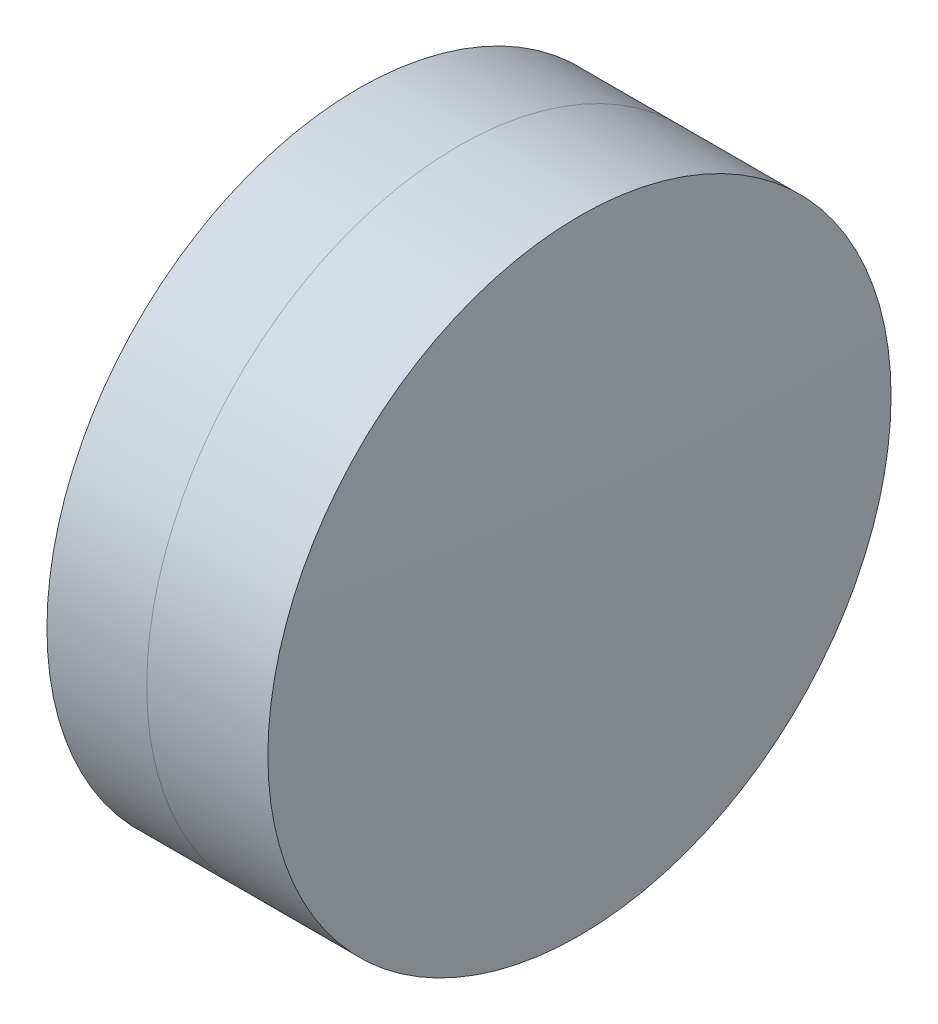
ISO-10303-21;
HEADER;
FILE_DESCRIPTION(('STEP AP214'),'2;1');
FILE_NAME('part.step','',(''),(''),'','','');
FILE_SCHEMA(('AUTOMOTIVE_DESIGN { 1 0 10303 214 1 1 1 1 }'));
ENDSEC;
DATA;
#1=APPLICATION_CONTEXT('core data for automotive mechanical design processes');
#2=APPLICATION_PROTOCOL_DEFINITION('international standard','automotive_design',2000,#1);
#3=PRODUCT_CONTEXT('',#1,'mechanical');
#4=PRODUCT('Part','Part','',(#3));
#5=PRODUCT_RELATED_PRODUCT_CATEGORY('part','',(#4));
#6=PRODUCT_DEFINITION_FORMATION('','',#4);
#7=PRODUCT_DEFINITION_CONTEXT('part definition',#1,'design');
#8=PRODUCT_DEFINITION('design','',#6,#7);
#9=PRODUCT_DEFINITION_SHAPE('','',#8);
#10=(LENGTH_UNIT() NAMED_UNIT(*) SI_UNIT(.MILLI.,.METRE.));
#11=(NAMED_UNIT(*) PLANE_ANGLE_UNIT() SI_UNIT($,.RADIAN.));
#12=(NAMED_UNIT(*) SI_UNIT($,.STERADIAN.) SOLID_ANGLE_UNIT());
#13=UNCERTAINTY_MEASURE_WITH_UNIT(LENGTH_MEASURE(1.E-05),#10,'distance_accuracy_value','');
#14=(GEOMETRIC_REPRESENTATION_CONTEXT(3) GLOBAL_UNCERTAINTY_ASSIGNED_CONTEXT((#13)) GLOBAL_UNIT_ASSIGNED_CONTEXT((#10,
#11,#12)) REPRESENTATION_CONTEXT('',''));
#15=CARTESIAN_POINT('',(0.,0.,0.));
#16=DIRECTION('',(0.,0.,1.));
#17=DIRECTION('',(1.,0.,0.));
#18=AXIS2_PLACEMENT_3D('',#15,#16,#17);
#19=CARTESIAN_POINT('',(-16.3125512292951,0.,0.));
#20=DIRECTION('',(-1.,0.,0.));
#21=DIRECTION('',(0.,0.,1.));
#22=AXIS2_PLACEMENT_3D('',#19,#20,#21);
#23=SPHERICAL_SURFACE('',#22,25.369);
#24=CARTESIAN_POINT('',(8.55884119252153,0.,0.));
#25=DIRECTION('',(-1.,0.,0.));
#26=DIRECTION('',(0.,0.,1.));
#27=AXIS2_PLACEMENT_3D('',#24,#25,#26);
#28=CIRCLE('',#27,5.00000000000001);
#29=CARTESIAN_POINT('',(8.55884119252153,0.,5.00000000000001));
#30=VERTEX_POINT('',#29);
#31=EDGE_CURVE('E11',#30,#30,#28,.T.);
#32=ORIENTED_EDGE('',*,*,#31,.T.);
#33=EDGE_LOOP('',(#32));
#34=FACE_BOUND('',#33,.T.);
#35=ADVANCED_FACE('F47',(#34),#23,.F.);
#36=CARTESIAN_POINT('',(-0.551919992657797,0.,0.));
#37=DIRECTION('',(-1.,0.,0.));
#38=DIRECTION('',(0.,0.,1.));
#39=AXIS2_PLACEMENT_3D('',#36,#37,#38);
#40=CYLINDRICAL_SURFACE('',#39,5.);
#41=CARTESIAN_POINT('',(10.5031711329197,0.,0.));
#42=DIRECTION('',(-1.,0.,0.));
#43=DIRECTION('',(0.,0.,1.));
#44=AXIS2_PLACEMENT_3D('',#41,#42,#43);
#45=CIRCLE('',#44,5.);
#46=CARTESIAN_POINT('',(10.5031711329197,0.,5.));
#47=VERTEX_POINT('',#46);
#48=EDGE_CURVE('E53',#47,#47,#45,.T.);
#49=ORIENTED_EDGE('',*,*,#48,.T.);
#50=EDGE_LOOP('',(#49));
#51=FACE_BOUND('',#50,.T.);
#52=ORIENTED_EDGE('',*,*,#31,.F.);
#53=EDGE_LOOP('',(#52));
#54=FACE_BOUND('',#53,.T.);
#55=ADVANCED_FACE('F59',(#51,#54),#40,.T.);
#56=CARTESIAN_POINT('',(-70.9715512292951,0.,0.));
#57=DIRECTION('',(-1.,0.,0.));
#58=DIRECTION('',(0.,0.,1.));
#59=AXIS2_PLACEMENT_3D('',#56,#57,#58);
#60=SPHERICAL_SURFACE('',#59,81.628);
#61=ORIENTED_EDGE('',*,*,#48,.F.);
#62=EDGE_LOOP('',(#61));
#63=FACE_BOUND('',#62,.T.);
#64=ADVANCED_FACE('F62',(#63),#60,.T.);
#65=CLOSED_SHELL('',(#35,#55,#64));
#66=MANIFOLD_SOLID_BREP('B2',#65);
#67=CARTESIAN_POINT('',(45.7204487707049,0.,0.));
#68=DIRECTION('',(-1.,0.,0.));
#69=DIRECTION('',(0.,0.,1.));
#70=AXIS2_PLACEMENT_3D('',#67,#68,#69);
#71=SPHERICAL_SURFACE('',#70,39.084);
#72=CARTESIAN_POINT('',(6.9575921164282,0.,0.));
#73=DIRECTION('',(-1.,0.,0.));
#74=DIRECTION('',(0.,0.,1.));
#75=AXIS2_PLACEMENT_3D('',#72,#73,#74);
#76=CIRCLE('',#75,5.);
#77=CARTESIAN_POINT('',(6.9575921164282,0.,5.));
#78=VERTEX_POINT('',#77);
#79=EDGE_CURVE('E46',#78,#78,#76,.T.);
#80=ORIENTED_EDGE('',*,*,#79,.T.);
#81=EDGE_LOOP('',(#80));
#82=FACE_BOUND('',#81,.T.);
#83=ADVANCED_FACE('F88',(#82),#71,.T.);
#84=CARTESIAN_POINT('',(-9.70261217833668,0.,0.));
#85=DIRECTION('',(-1.,0.,0.));
#86=DIRECTION('',(0.,0.,1.));
#87=AXIS2_PLACEMENT_3D('',#84,#85,#86);
#88=CYLINDRICAL_SURFACE('',#87,5.);
#89=CARTESIAN_POINT('',(8.55884119252154,0.,0.));
#90=DIRECTION('',(-1.,0.,0.));
#91=DIRECTION('',(0.,0.,1.));
#92=AXIS2_PLACEMENT_3D('',#89,#90,#91);
#93=CIRCLE('',#92,5.);
#94=CARTESIAN_POINT('',(8.55884119252154,0.,5.));
#95=VERTEX_POINT('',#94);
#96=EDGE_CURVE('E94',#95,#95,#93,.T.);
#97=ORIENTED_EDGE('',*,*,#96,.T.);
#98=EDGE_LOOP('',(#97));
#99=FACE_BOUND('',#98,.T.);
#100=ORIENTED_EDGE('',*,*,#79,.F.);
#101=EDGE_LOOP('',(#100));
#102=FACE_BOUND('',#101,.T.);
#103=ADVANCED_FACE('F100',(#99,#102),#88,.T.);
#104=CARTESIAN_POINT('',(-16.3125512292951,0.,0.));
#105=DIRECTION('',(-1.,0.,0.));
#106=DIRECTION('',(0.,0.,1.));
#107=AXIS2_PLACEMENT_3D('',#104,#105,#106);
#108=SPHERICAL_SURFACE('',#107,25.369);
#109=ORIENTED_EDGE('',*,*,#96,.F.);
#110=EDGE_LOOP('',(#109));
#111=FACE_BOUND('',#110,.T.);
#112=ADVANCED_FACE('F103',(#111),#108,.T.);
#113=CLOSED_SHELL('',(#83,#103,#112));
#114=MANIFOLD_SOLID_BREP('B6',#113);
#115=ADVANCED_BREP_SHAPE_REPRESENTATION('',(#18,#66,#114),#14);
#116=SHAPE_DEFINITION_REPRESENTATION(#9,#115);
ENDSEC;
END-ISO-10303-21;
